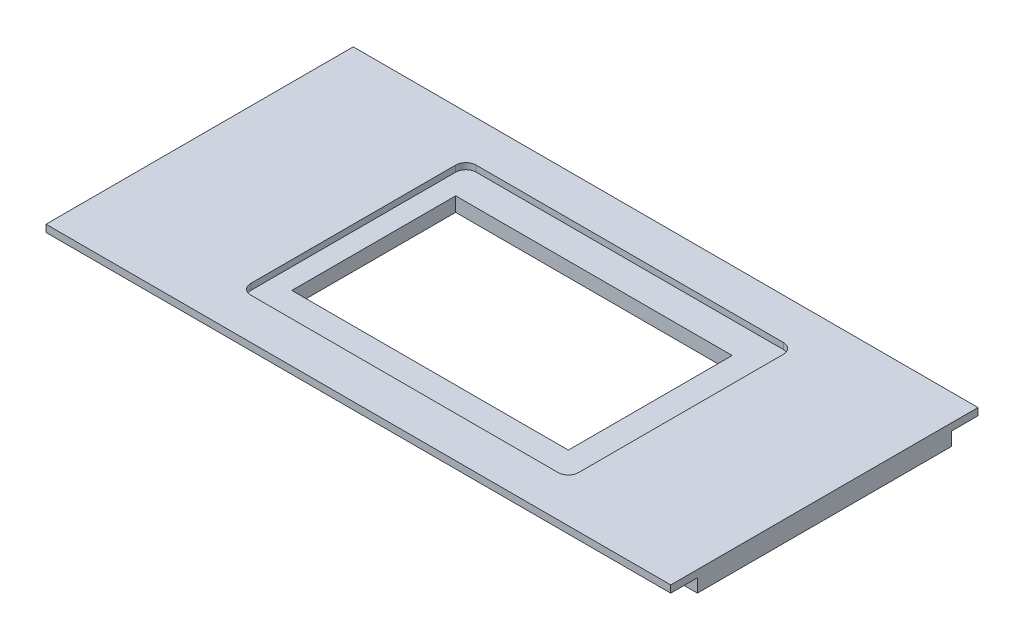
ISO-10303-21;
HEADER;
FILE_DESCRIPTION(('STEP AP214'),'2;1');
FILE_NAME('part.step','',(''),(''),'','','');
FILE_SCHEMA(('AUTOMOTIVE_DESIGN { 1 0 10303 214 1 1 1 1 }'));
ENDSEC;
DATA;
#1=APPLICATION_CONTEXT('core data for automotive mechanical design processes');
#2=APPLICATION_PROTOCOL_DEFINITION('international standard','automotive_design',2000,#1);
#3=PRODUCT_CONTEXT('',#1,'mechanical');
#4=PRODUCT('Part','Part','',(#3));
#5=PRODUCT_RELATED_PRODUCT_CATEGORY('part','',(#4));
#6=PRODUCT_DEFINITION_FORMATION('','',#4);
#7=PRODUCT_DEFINITION_CONTEXT('part definition',#1,'design');
#8=PRODUCT_DEFINITION('design','',#6,#7);
#9=PRODUCT_DEFINITION_SHAPE('','',#8);
#10=(LENGTH_UNIT() NAMED_UNIT(*) SI_UNIT(.MILLI.,.METRE.));
#11=(NAMED_UNIT(*) PLANE_ANGLE_UNIT() SI_UNIT($,.RADIAN.));
#12=(NAMED_UNIT(*) SI_UNIT($,.STERADIAN.) SOLID_ANGLE_UNIT());
#13=UNCERTAINTY_MEASURE_WITH_UNIT(LENGTH_MEASURE(1.E-05),#10,'distance_accuracy_value','');
#14=(GEOMETRIC_REPRESENTATION_CONTEXT(3) GLOBAL_UNCERTAINTY_ASSIGNED_CONTEXT((#13)) GLOBAL_UNIT_ASSIGNED_CONTEXT((#10,
#11,#12)) REPRESENTATION_CONTEXT('',''));
#15=CARTESIAN_POINT('',(0.,0.,0.));
#16=DIRECTION('',(0.,0.,1.));
#17=DIRECTION('',(1.,0.,0.));
#18=AXIS2_PLACEMENT_3D('',#15,#16,#17);
#19=CARTESIAN_POINT('',(0.,2.,0.));
#20=DIRECTION('',(0.,-1.,0.));
#21=DIRECTION('',(0.,0.,-1.));
#22=AXIS2_PLACEMENT_3D('',#19,#20,#21);
#23=PLANE('',#22);
#24=DIRECTION('',(0.,0.,1.));
#25=VECTOR('',#24,1.);
#26=CARTESIAN_POINT('',(-77.5,2.,55.));
#27=LINE('',#26,#25);
#28=CARTESIAN_POINT('',(-77.5,2.,-50.));
#29=VERTEX_POINT('',#28);
#30=CARTESIAN_POINT('',(-77.5,2.,50.));
#31=VERTEX_POINT('',#30);
#32=EDGE_CURVE('E212',#29,#31,#27,.T.);
#33=ORIENTED_EDGE('',*,*,#32,.T.);
#34=CARTESIAN_POINT('',(-72.5,2.,50.));
#35=DIRECTION('',(0.,-1.,0.));
#36=DIRECTION('',(0.,0.,-1.));
#37=AXIS2_PLACEMENT_3D('',#34,#35,#36);
#38=CIRCLE('',#37,5.);
#39=CARTESIAN_POINT('',(-72.5,2.,55.));
#40=VERTEX_POINT('',#39);
#41=EDGE_CURVE('E310',#31,#40,#38,.F.);
#42=ORIENTED_EDGE('',*,*,#41,.T.);
#43=DIRECTION('',(1.,0.,0.));
#44=VECTOR('',#43,1.);
#45=CARTESIAN_POINT('',(-77.5,2.,55.));
#46=LINE('',#45,#44);
#47=CARTESIAN_POINT('',(77.5,2.,55.));
#48=VERTEX_POINT('',#47);
#49=EDGE_CURVE('E215',#40,#48,#46,.T.);
#50=ORIENTED_EDGE('',*,*,#49,.T.);
#51=CARTESIAN_POINT('',(77.5,2.,50.));
#52=DIRECTION('',(0.,-1.,0.));
#53=DIRECTION('',(0.,0.,-1.));
#54=AXIS2_PLACEMENT_3D('',#51,#52,#53);
#55=CIRCLE('',#54,5.);
#56=CARTESIAN_POINT('',(82.5,2.,50.));
#57=VERTEX_POINT('',#56);
#58=EDGE_CURVE('E308',#48,#57,#55,.F.);
#59=ORIENTED_EDGE('',*,*,#58,.T.);
#60=DIRECTION('',(0.,0.,-1.));
#61=VECTOR('',#60,1.);
#62=CARTESIAN_POINT('',(82.5,2.,55.));
#63=LINE('',#62,#61);
#64=CARTESIAN_POINT('',(82.5,2.,-50.));
#65=VERTEX_POINT('',#64);
#66=EDGE_CURVE('E219',#57,#65,#63,.T.);
#67=ORIENTED_EDGE('',*,*,#66,.T.);
#68=CARTESIAN_POINT('',(77.5,2.,-50.));
#69=DIRECTION('',(0.,-1.,0.));
#70=DIRECTION('',(0.,0.,-1.));
#71=AXIS2_PLACEMENT_3D('',#68,#69,#70);
#72=CIRCLE('',#71,5.);
#73=CARTESIAN_POINT('',(77.5,2.,-55.));
#74=VERTEX_POINT('',#73);
#75=EDGE_CURVE('E306',#65,#74,#72,.F.);
#76=ORIENTED_EDGE('',*,*,#75,.T.);
#77=DIRECTION('',(-1.,0.,0.));
#78=VECTOR('',#77,1.);
#79=CARTESIAN_POINT('',(-77.5,2.,-55.));
#80=LINE('',#79,#78);
#81=CARTESIAN_POINT('',(-72.5,2.,-55.));
#82=VERTEX_POINT('',#81);
#83=EDGE_CURVE('E222',#74,#82,#80,.T.);
#84=ORIENTED_EDGE('',*,*,#83,.T.);
#85=CARTESIAN_POINT('',(-72.5,2.,-50.));
#86=DIRECTION('',(0.,-1.,0.));
#87=DIRECTION('',(0.,0.,-1.));
#88=AXIS2_PLACEMENT_3D('',#85,#86,#87);
#89=CIRCLE('',#88,5.);
#90=EDGE_CURVE('E304',#82,#29,#89,.F.);
#91=ORIENTED_EDGE('',*,*,#90,.T.);
#92=EDGE_LOOP('',(#33,#42,#50,#59,#67,#76,#84,#91));
#93=FACE_BOUND('',#92,.T.);
#94=DIRECTION('',(0.,0.,-1.));
#95=VECTOR('',#94,1.);
#96=CARTESIAN_POINT('',(67.5,2.,-40.));
#97=LINE('',#96,#95);
#98=CARTESIAN_POINT('',(67.5,2.,40.));
#99=VERTEX_POINT('',#98);
#100=CARTESIAN_POINT('',(67.5,2.,-40.));
#101=VERTEX_POINT('',#100);
#102=EDGE_CURVE('E180',#99,#101,#97,.T.);
#103=ORIENTED_EDGE('',*,*,#102,.F.);
#104=DIRECTION('',(1.,0.,0.));
#105=VECTOR('',#104,1.);
#106=CARTESIAN_POINT('',(-67.5,2.,40.));
#107=LINE('',#106,#105);
#108=CARTESIAN_POINT('',(-67.5,2.,40.));
#109=VERTEX_POINT('',#108);
#110=EDGE_CURVE('E195',#109,#99,#107,.T.);
#111=ORIENTED_EDGE('',*,*,#110,.F.);
#112=DIRECTION('',(0.,0.,1.));
#113=VECTOR('',#112,1.);
#114=CARTESIAN_POINT('',(-67.5,2.,-40.));
#115=LINE('',#114,#113);
#116=CARTESIAN_POINT('',(-67.5,2.,-40.));
#117=VERTEX_POINT('',#116);
#118=EDGE_CURVE('E53',#117,#109,#115,.T.);
#119=ORIENTED_EDGE('',*,*,#118,.F.);
#120=DIRECTION('',(-1.,0.,0.));
#121=VECTOR('',#120,1.);
#122=CARTESIAN_POINT('',(-67.5,2.,-40.));
#123=LINE('',#122,#121);
#124=EDGE_CURVE('E203',#101,#117,#123,.T.);
#125=ORIENTED_EDGE('',*,*,#124,.F.);
#126=EDGE_LOOP('',(#103,#111,#119,#125));
#127=FACE_BOUND('',#126,.T.);
#128=ADVANCED_FACE('F38',(#93,#127),#23,.F.);
#129=CARTESIAN_POINT('',(152.5,5.,-75.));
#130=DIRECTION('',(-1.,0.,0.));
#131=DIRECTION('',(0.,0.,1.));
#132=AXIS2_PLACEMENT_3D('',#129,#130,#131);
#133=PLANE('',#132);
#134=DIRECTION('',(0.,-1.,0.));
#135=VECTOR('',#134,1.);
#136=CARTESIAN_POINT('',(152.5,5.,75.));
#137=LINE('',#136,#135);
#138=CARTESIAN_POINT('',(152.5,5.,75.));
#139=VERTEX_POINT('',#138);
#140=CARTESIAN_POINT('',(152.5,1.5,75.));
#141=VERTEX_POINT('',#140);
#142=EDGE_CURVE('E278',#139,#141,#137,.T.);
#143=ORIENTED_EDGE('',*,*,#142,.T.);
#144=DIRECTION('',(0.,0.,1.));
#145=VECTOR('',#144,1.);
#146=CARTESIAN_POINT('',(152.5,1.5,75.));
#147=LINE('',#146,#145);
#148=CARTESIAN_POINT('',(152.5,1.5,62.));
#149=VERTEX_POINT('',#148);
#150=EDGE_CURVE('E245',#149,#141,#147,.T.);
#151=ORIENTED_EDGE('',*,*,#150,.F.);
#152=DIRECTION('',(0.,1.,0.));
#153=VECTOR('',#152,1.);
#154=CARTESIAN_POINT('',(152.5,-5.,62.));
#155=LINE('',#154,#153);
#156=CARTESIAN_POINT('',(152.5,-5.,62.));
#157=VERTEX_POINT('',#156);
#158=EDGE_CURVE('E242',#157,#149,#155,.T.);
#159=ORIENTED_EDGE('',*,*,#158,.F.);
#160=DIRECTION('',(0.,0.,-1.));
#161=VECTOR('',#160,1.);
#162=CARTESIAN_POINT('',(152.5,-5.,-75.));
#163=LINE('',#162,#161);
#164=CARTESIAN_POINT('',(152.5,-5.,-62.));
#165=VERTEX_POINT('',#164);
#166=EDGE_CURVE('E241',#157,#165,#163,.T.);
#167=ORIENTED_EDGE('',*,*,#166,.T.);
#168=DIRECTION('',(0.,-1.,0.));
#169=VECTOR('',#168,1.);
#170=CARTESIAN_POINT('',(152.5,-5.,-62.));
#171=LINE('',#170,#169);
#172=CARTESIAN_POINT('',(152.5,1.5,-62.));
#173=VERTEX_POINT('',#172);
#174=EDGE_CURVE('E258',#173,#165,#171,.T.);
#175=ORIENTED_EDGE('',*,*,#174,.F.);
#176=DIRECTION('',(0.,0.,1.));
#177=VECTOR('',#176,1.);
#178=CARTESIAN_POINT('',(152.5,1.5,-75.));
#179=LINE('',#178,#177);
#180=CARTESIAN_POINT('',(152.5,1.5,-75.));
#181=VERTEX_POINT('',#180);
#182=EDGE_CURVE('E246',#181,#173,#179,.T.);
#183=ORIENTED_EDGE('',*,*,#182,.F.);
#184=DIRECTION('',(0.,-1.,0.));
#185=VECTOR('',#184,1.);
#186=CARTESIAN_POINT('',(152.5,5.,-75.));
#187=LINE('',#186,#185);
#188=CARTESIAN_POINT('',(152.5,5.,-75.));
#189=VERTEX_POINT('',#188);
#190=EDGE_CURVE('E291',#189,#181,#187,.T.);
#191=ORIENTED_EDGE('',*,*,#190,.F.);
#192=DIRECTION('',(0.,0.,-1.));
#193=VECTOR('',#192,1.);
#194=CARTESIAN_POINT('',(152.5,5.,-75.));
#195=LINE('',#194,#193);
#196=EDGE_CURVE('E268',#139,#189,#195,.T.);
#197=ORIENTED_EDGE('',*,*,#196,.F.);
#198=EDGE_LOOP('',(#143,#151,#159,#167,#175,#183,#191,#197));
#199=FACE_BOUND('',#198,.T.);
#200=ADVANCED_FACE('F373',(#199),#133,.F.);
#201=CARTESIAN_POINT('',(-152.5,5.,-75.));
#202=DIRECTION('',(0.,0.,1.));
#203=DIRECTION('',(1.,0.,0.));
#204=AXIS2_PLACEMENT_3D('',#201,#202,#203);
#205=PLANE('',#204);
#206=ORIENTED_EDGE('',*,*,#190,.T.);
#207=DIRECTION('',(1.,0.,0.));
#208=VECTOR('',#207,1.);
#209=CARTESIAN_POINT('',(-167.034441853749,1.5,-74.9999999999999));
#210=LINE('',#209,#208);
#211=CARTESIAN_POINT('',(-152.5,1.5,-75.));
#212=VERTEX_POINT('',#211);
#213=EDGE_CURVE('E256',#212,#181,#210,.T.);
#214=ORIENTED_EDGE('',*,*,#213,.F.);
#215=DIRECTION('',(0.,-1.,0.));
#216=VECTOR('',#215,1.);
#217=CARTESIAN_POINT('',(-152.5,5.,-75.));
#218=LINE('',#217,#216);
#219=CARTESIAN_POINT('',(-152.5,5.,-75.));
#220=VERTEX_POINT('',#219);
#221=EDGE_CURVE('E288',#220,#212,#218,.T.);
#222=ORIENTED_EDGE('',*,*,#221,.F.);
#223=DIRECTION('',(-1.,0.,0.));
#224=VECTOR('',#223,1.);
#225=CARTESIAN_POINT('',(-152.5,5.,-75.));
#226=LINE('',#225,#224);
#227=EDGE_CURVE('E271',#189,#220,#226,.T.);
#228=ORIENTED_EDGE('',*,*,#227,.F.);
#229=EDGE_LOOP('',(#206,#214,#222,#228));
#230=FACE_BOUND('',#229,.T.);
#231=ADVANCED_FACE('F380',(#230),#205,.F.);
#232=CARTESIAN_POINT('',(-152.5,5.,-75.));
#233=DIRECTION('',(1.,0.,0.));
#234=DIRECTION('',(0.,0.,-1.));
#235=AXIS2_PLACEMENT_3D('',#232,#233,#234);
#236=PLANE('',#235);
#237=DIRECTION('',(0.,-1.,0.));
#238=VECTOR('',#237,1.);
#239=CARTESIAN_POINT('',(-152.5,-5.,62.));
#240=LINE('',#239,#238);
#241=CARTESIAN_POINT('',(-152.5,1.5,62.));
#242=VERTEX_POINT('',#241);
#243=CARTESIAN_POINT('',(-152.5,-5.,62.));
#244=VERTEX_POINT('',#243);
#245=EDGE_CURVE('E236',#242,#244,#240,.T.);
#246=ORIENTED_EDGE('',*,*,#245,.F.);
#247=DIRECTION('',(0.,0.,-1.));
#248=VECTOR('',#247,1.);
#249=CARTESIAN_POINT('',(-152.5,1.5,75.));
#250=LINE('',#249,#248);
#251=CARTESIAN_POINT('',(-152.5,1.5,75.));
#252=VERTEX_POINT('',#251);
#253=EDGE_CURVE('E238',#252,#242,#250,.T.);
#254=ORIENTED_EDGE('',*,*,#253,.F.);
#255=DIRECTION('',(0.,-1.,0.));
#256=VECTOR('',#255,1.);
#257=CARTESIAN_POINT('',(-152.5,5.,75.));
#258=LINE('',#257,#256);
#259=CARTESIAN_POINT('',(-152.5,5.,75.));
#260=VERTEX_POINT('',#259);
#261=EDGE_CURVE('E285',#260,#252,#258,.T.);
#262=ORIENTED_EDGE('',*,*,#261,.F.);
#263=DIRECTION('',(0.,0.,1.));
#264=VECTOR('',#263,1.);
#265=CARTESIAN_POINT('',(-152.5,5.,-75.));
#266=LINE('',#265,#264);
#267=EDGE_CURVE('E274',#220,#260,#266,.T.);
#268=ORIENTED_EDGE('',*,*,#267,.F.);
#269=ORIENTED_EDGE('',*,*,#221,.T.);
#270=DIRECTION('',(0.,0.,-1.));
#271=VECTOR('',#270,1.);
#272=CARTESIAN_POINT('',(-152.5,1.5,-74.9999999999999));
#273=LINE('',#272,#271);
#274=CARTESIAN_POINT('',(-152.5,1.5,-61.9999999999999));
#275=VERTEX_POINT('',#274);
#276=EDGE_CURVE('E225',#275,#212,#273,.T.);
#277=ORIENTED_EDGE('',*,*,#276,.F.);
#278=DIRECTION('',(0.,1.,0.));
#279=VECTOR('',#278,1.);
#280=CARTESIAN_POINT('',(-152.5,-5.,-61.9999999999999));
#281=LINE('',#280,#279);
#282=CARTESIAN_POINT('',(-152.5,-5.,-61.9999999999999));
#283=VERTEX_POINT('',#282);
#284=EDGE_CURVE('E255',#283,#275,#281,.T.);
#285=ORIENTED_EDGE('',*,*,#284,.F.);
#286=DIRECTION('',(0.,0.,1.));
#287=VECTOR('',#286,1.);
#288=CARTESIAN_POINT('',(-152.5,-5.,-75.));
#289=LINE('',#288,#287);
#290=EDGE_CURVE('E272',#283,#244,#289,.T.);
#291=ORIENTED_EDGE('',*,*,#290,.T.);
#292=EDGE_LOOP('',(#246,#254,#262,#268,#269,#277,#285,#291));
#293=FACE_BOUND('',#292,.T.);
#294=ADVANCED_FACE('F416',(#293),#236,.F.);
#295=CARTESIAN_POINT('',(-152.5,5.,75.));
#296=DIRECTION('',(0.,0.,-1.));
#297=DIRECTION('',(-1.,0.,0.));
#298=AXIS2_PLACEMENT_3D('',#295,#296,#297);
#299=PLANE('',#298);
#300=ORIENTED_EDGE('',*,*,#261,.T.);
#301=DIRECTION('',(1.,0.,0.));
#302=VECTOR('',#301,1.);
#303=CARTESIAN_POINT('',(-167.034441853749,1.5,75.));
#304=LINE('',#303,#302);
#305=EDGE_CURVE('E239',#252,#141,#304,.T.);
#306=ORIENTED_EDGE('',*,*,#305,.T.);
#307=ORIENTED_EDGE('',*,*,#142,.F.);
#308=DIRECTION('',(1.,0.,0.));
#309=VECTOR('',#308,1.);
#310=CARTESIAN_POINT('',(-152.5,5.,75.));
#311=LINE('',#310,#309);
#312=EDGE_CURVE('E276',#260,#139,#311,.T.);
#313=ORIENTED_EDGE('',*,*,#312,.F.);
#314=EDGE_LOOP('',(#300,#306,#307,#313));
#315=FACE_BOUND('',#314,.T.);
#316=ADVANCED_FACE('F412',(#315),#299,.F.);
#317=CARTESIAN_POINT('',(0.,5.,0.));
#318=DIRECTION('',(0.,1.,0.));
#319=DIRECTION('',(0.,0.,1.));
#320=AXIS2_PLACEMENT_3D('',#317,#318,#319);
#321=PLANE('',#320);
#322=DIRECTION('',(0.,0.,1.));
#323=VECTOR('',#322,1.);
#324=CARTESIAN_POINT('',(-77.5,5.,55.));
#325=LINE('',#324,#323);
#326=CARTESIAN_POINT('',(-77.5,5.,-50.));
#327=VERTEX_POINT('',#326);
#328=CARTESIAN_POINT('',(-77.5,5.,50.));
#329=VERTEX_POINT('',#328);
#330=EDGE_CURVE('E208',#327,#329,#325,.T.);
#331=ORIENTED_EDGE('',*,*,#330,.F.);
#332=CARTESIAN_POINT('',(-72.5,5.,-50.));
#333=DIRECTION('',(0.,1.,0.));
#334=DIRECTION('',(0.,0.,1.));
#335=AXIS2_PLACEMENT_3D('',#332,#333,#334);
#336=CIRCLE('',#335,5.);
#337=CARTESIAN_POINT('',(-72.5,5.,-55.));
#338=VERTEX_POINT('',#337);
#339=EDGE_CURVE('E11',#327,#338,#336,.F.);
#340=ORIENTED_EDGE('',*,*,#339,.T.);
#341=DIRECTION('',(-1.,0.,0.));
#342=VECTOR('',#341,1.);
#343=CARTESIAN_POINT('',(-77.5,5.,-55.));
#344=LINE('',#343,#342);
#345=CARTESIAN_POINT('',(77.5,5.,-55.));
#346=VERTEX_POINT('',#345);
#347=EDGE_CURVE('E216',#346,#338,#344,.T.);
#348=ORIENTED_EDGE('',*,*,#347,.F.);
#349=CARTESIAN_POINT('',(77.5,5.,-50.));
#350=DIRECTION('',(0.,1.,0.));
#351=DIRECTION('',(0.,0.,1.));
#352=AXIS2_PLACEMENT_3D('',#349,#350,#351);
#353=CIRCLE('',#352,5.);
#354=CARTESIAN_POINT('',(82.5,5.,-50.));
#355=VERTEX_POINT('',#354);
#356=EDGE_CURVE('E46',#346,#355,#353,.F.);
#357=ORIENTED_EDGE('',*,*,#356,.T.);
#358=DIRECTION('',(0.,0.,-1.));
#359=VECTOR('',#358,1.);
#360=CARTESIAN_POINT('',(82.5,5.,55.));
#361=LINE('',#360,#359);
#362=CARTESIAN_POINT('',(82.5,5.,50.));
#363=VERTEX_POINT('',#362);
#364=EDGE_CURVE('E231',#363,#355,#361,.T.);
#365=ORIENTED_EDGE('',*,*,#364,.F.);
#366=CARTESIAN_POINT('',(77.5,5.,50.));
#367=DIRECTION('',(0.,1.,0.));
#368=DIRECTION('',(0.,0.,1.));
#369=AXIS2_PLACEMENT_3D('',#366,#367,#368);
#370=CIRCLE('',#369,5.);
#371=CARTESIAN_POINT('',(77.5,5.,55.));
#372=VERTEX_POINT('',#371);
#373=EDGE_CURVE('E324',#363,#372,#370,.F.);
#374=ORIENTED_EDGE('',*,*,#373,.T.);
#375=DIRECTION('',(1.,0.,0.));
#376=VECTOR('',#375,1.);
#377=CARTESIAN_POINT('',(-77.5,5.,55.));
#378=LINE('',#377,#376);
#379=CARTESIAN_POINT('',(-72.5,5.,55.));
#380=VERTEX_POINT('',#379);
#381=EDGE_CURVE('E228',#380,#372,#378,.T.);
#382=ORIENTED_EDGE('',*,*,#381,.F.);
#383=CARTESIAN_POINT('',(-72.5,5.,50.));
#384=DIRECTION('',(0.,1.,0.));
#385=DIRECTION('',(0.,0.,1.));
#386=AXIS2_PLACEMENT_3D('',#383,#384,#385);
#387=CIRCLE('',#386,5.);
#388=EDGE_CURVE('E322',#380,#329,#387,.F.);
#389=ORIENTED_EDGE('',*,*,#388,.T.);
#390=EDGE_LOOP('',(#331,#340,#348,#357,#365,#374,#382,#389));
#391=FACE_BOUND('',#390,.T.);
#392=ORIENTED_EDGE('',*,*,#196,.T.);
#393=ORIENTED_EDGE('',*,*,#227,.T.);
#394=ORIENTED_EDGE('',*,*,#267,.T.);
#395=ORIENTED_EDGE('',*,*,#312,.T.);
#396=EDGE_LOOP('',(#392,#393,#394,#395));
#397=FACE_BOUND('',#396,.T.);
#398=ADVANCED_FACE('F329',(#391,#397),#321,.T.);
#399=CARTESIAN_POINT('',(0.,-5.,0.));
#400=DIRECTION('',(0.,1.,0.));
#401=DIRECTION('',(0.,0.,1.));
#402=AXIS2_PLACEMENT_3D('',#399,#400,#401);
#403=PLANE('',#402);
#404=DIRECTION('',(1.,0.,0.));
#405=VECTOR('',#404,1.);
#406=CARTESIAN_POINT('',(-67.5,-5.,40.));
#407=LINE('',#406,#405);
#408=CARTESIAN_POINT('',(-67.5,-5.,40.));
#409=VERTEX_POINT('',#408);
#410=CARTESIAN_POINT('',(67.5,-5.,40.));
#411=VERTEX_POINT('',#410);
#412=EDGE_CURVE('E185',#409,#411,#407,.T.);
#413=ORIENTED_EDGE('',*,*,#412,.T.);
#414=DIRECTION('',(0.,0.,-1.));
#415=VECTOR('',#414,1.);
#416=CARTESIAN_POINT('',(67.5,-5.,-40.));
#417=LINE('',#416,#415);
#418=CARTESIAN_POINT('',(67.5,-5.,-40.));
#419=VERTEX_POINT('',#418);
#420=EDGE_CURVE('E177',#411,#419,#417,.T.);
#421=ORIENTED_EDGE('',*,*,#420,.T.);
#422=DIRECTION('',(-1.,0.,0.));
#423=VECTOR('',#422,1.);
#424=CARTESIAN_POINT('',(-67.5,-5.,-40.));
#425=LINE('',#424,#423);
#426=CARTESIAN_POINT('',(-67.5,-5.,-40.));
#427=VERTEX_POINT('',#426);
#428=EDGE_CURVE('E188',#419,#427,#425,.T.);
#429=ORIENTED_EDGE('',*,*,#428,.T.);
#430=DIRECTION('',(0.,0.,1.));
#431=VECTOR('',#430,1.);
#432=CARTESIAN_POINT('',(-67.5,-5.,-40.));
#433=LINE('',#432,#431);
#434=EDGE_CURVE('E58',#427,#409,#433,.T.);
#435=ORIENTED_EDGE('',*,*,#434,.T.);
#436=EDGE_LOOP('',(#413,#421,#429,#435));
#437=FACE_BOUND('',#436,.T.);
#438=ORIENTED_EDGE('',*,*,#166,.F.);
#439=DIRECTION('',(1.,0.,0.));
#440=VECTOR('',#439,1.);
#441=CARTESIAN_POINT('',(-167.034441853749,-5.,62.));
#442=LINE('',#441,#440);
#443=EDGE_CURVE('E248',#244,#157,#442,.T.);
#444=ORIENTED_EDGE('',*,*,#443,.F.);
#445=ORIENTED_EDGE('',*,*,#290,.F.);
#446=DIRECTION('',(1.,0.,0.));
#447=VECTOR('',#446,1.);
#448=CARTESIAN_POINT('',(-167.034441853749,-5.,-61.9999999999999));
#449=LINE('',#448,#447);
#450=EDGE_CURVE('E261',#283,#165,#449,.T.);
#451=ORIENTED_EDGE('',*,*,#450,.T.);
#452=EDGE_LOOP('',(#438,#444,#445,#451));
#453=FACE_BOUND('',#452,.T.);
#454=ADVANCED_FACE('F192',(#437,#453),#403,.F.);
#455=CARTESIAN_POINT('',(-167.034441853749,-5.,-61.9999999999999));
#456=DIRECTION('',(0.,0.,1.));
#457=DIRECTION('',(1.,0.,0.));
#458=AXIS2_PLACEMENT_3D('',#455,#456,#457);
#459=PLANE('',#458);
#460=ORIENTED_EDGE('',*,*,#284,.T.);
#461=DIRECTION('',(1.,0.,0.));
#462=VECTOR('',#461,1.);
#463=CARTESIAN_POINT('',(-167.034441853749,1.5,-61.9999999999999));
#464=LINE('',#463,#462);
#465=EDGE_CURVE('E259',#275,#173,#464,.T.);
#466=ORIENTED_EDGE('',*,*,#465,.T.);
#467=ORIENTED_EDGE('',*,*,#174,.T.);
#468=ORIENTED_EDGE('',*,*,#450,.F.);
#469=EDGE_LOOP('',(#460,#466,#467,#468));
#470=FACE_BOUND('',#469,.T.);
#471=ADVANCED_FACE('F405',(#470),#459,.F.);
#472=CARTESIAN_POINT('',(-167.034441853749,1.5,-74.9999999999999));
#473=DIRECTION('',(0.,1.,0.));
#474=DIRECTION('',(0.,0.,1.));
#475=AXIS2_PLACEMENT_3D('',#472,#473,#474);
#476=PLANE('',#475);
#477=ORIENTED_EDGE('',*,*,#276,.T.);
#478=ORIENTED_EDGE('',*,*,#213,.T.);
#479=ORIENTED_EDGE('',*,*,#182,.T.);
#480=ORIENTED_EDGE('',*,*,#465,.F.);
#481=EDGE_LOOP('',(#477,#478,#479,#480));
#482=FACE_BOUND('',#481,.T.);
#483=ADVANCED_FACE('F398',(#482),#476,.F.);
#484=CARTESIAN_POINT('',(-167.034441853749,1.5,75.));
#485=DIRECTION('',(0.,1.,0.));
#486=DIRECTION('',(0.,0.,1.));
#487=AXIS2_PLACEMENT_3D('',#484,#485,#486);
#488=PLANE('',#487);
#489=ORIENTED_EDGE('',*,*,#253,.T.);
#490=DIRECTION('',(1.,0.,0.));
#491=VECTOR('',#490,1.);
#492=CARTESIAN_POINT('',(-167.034441853749,1.5,62.));
#493=LINE('',#492,#491);
#494=EDGE_CURVE('E251',#242,#149,#493,.T.);
#495=ORIENTED_EDGE('',*,*,#494,.T.);
#496=ORIENTED_EDGE('',*,*,#150,.T.);
#497=ORIENTED_EDGE('',*,*,#305,.F.);
#498=EDGE_LOOP('',(#489,#495,#496,#497));
#499=FACE_BOUND('',#498,.T.);
#500=ADVANCED_FACE('F395',(#499),#488,.F.);
#501=CARTESIAN_POINT('',(-167.034441853749,-5.,62.));
#502=DIRECTION('',(0.,0.,-1.));
#503=DIRECTION('',(-1.,0.,0.));
#504=AXIS2_PLACEMENT_3D('',#501,#502,#503);
#505=PLANE('',#504);
#506=ORIENTED_EDGE('',*,*,#245,.T.);
#507=ORIENTED_EDGE('',*,*,#443,.T.);
#508=ORIENTED_EDGE('',*,*,#158,.T.);
#509=ORIENTED_EDGE('',*,*,#494,.F.);
#510=EDGE_LOOP('',(#506,#507,#508,#509));
#511=FACE_BOUND('',#510,.T.);
#512=ADVANCED_FACE('F394',(#511),#505,.F.);
#513=CARTESIAN_POINT('',(-77.5,2.,55.));
#514=DIRECTION('',(-1.,0.,0.));
#515=DIRECTION('',(0.,0.,1.));
#516=AXIS2_PLACEMENT_3D('',#513,#514,#515);
#517=PLANE('',#516);
#518=ORIENTED_EDGE('',*,*,#330,.T.);
#519=DIRECTION('',(0.,1.,0.));
#520=VECTOR('',#519,1.);
#521=CARTESIAN_POINT('',(-77.5,2.,50.));
#522=LINE('',#521,#520);
#523=EDGE_CURVE('E302',#329,#31,#522,.F.);
#524=ORIENTED_EDGE('',*,*,#523,.T.);
#525=ORIENTED_EDGE('',*,*,#32,.F.);
#526=DIRECTION('',(0.,1.,0.));
#527=VECTOR('',#526,1.);
#528=CARTESIAN_POINT('',(-77.5,5.,-50.));
#529=LINE('',#528,#527);
#530=EDGE_CURVE('E299',#29,#327,#529,.T.);
#531=ORIENTED_EDGE('',*,*,#530,.T.);
#532=EDGE_LOOP('',(#518,#524,#525,#531));
#533=FACE_BOUND('',#532,.T.);
#534=ADVANCED_FACE('F352',(#533),#517,.F.);
#535=CARTESIAN_POINT('',(-77.5,2.,-55.));
#536=DIRECTION('',(0.,0.,-1.));
#537=DIRECTION('',(-1.,0.,0.));
#538=AXIS2_PLACEMENT_3D('',#535,#536,#537);
#539=PLANE('',#538);
#540=ORIENTED_EDGE('',*,*,#83,.F.);
#541=DIRECTION('',(0.,1.,0.));
#542=VECTOR('',#541,1.);
#543=CARTESIAN_POINT('',(77.5,5.,-55.));
#544=LINE('',#543,#542);
#545=EDGE_CURVE('E319',#74,#346,#544,.T.);
#546=ORIENTED_EDGE('',*,*,#545,.T.);
#547=ORIENTED_EDGE('',*,*,#347,.T.);
#548=DIRECTION('',(0.,1.,0.));
#549=VECTOR('',#548,1.);
#550=CARTESIAN_POINT('',(-72.5,2.,-55.));
#551=LINE('',#550,#549);
#552=EDGE_CURVE('E317',#338,#82,#551,.F.);
#553=ORIENTED_EDGE('',*,*,#552,.T.);
#554=EDGE_LOOP('',(#540,#546,#547,#553));
#555=FACE_BOUND('',#554,.T.);
#556=ADVANCED_FACE('F345',(#555),#539,.F.);
#557=CARTESIAN_POINT('',(82.5,2.,55.));
#558=DIRECTION('',(1.,0.,0.));
#559=DIRECTION('',(0.,0.,-1.));
#560=AXIS2_PLACEMENT_3D('',#557,#558,#559);
#561=PLANE('',#560);
#562=ORIENTED_EDGE('',*,*,#66,.F.);
#563=DIRECTION('',(0.,1.,0.));
#564=VECTOR('',#563,1.);
#565=CARTESIAN_POINT('',(82.5,5.,50.));
#566=LINE('',#565,#564);
#567=EDGE_CURVE('E314',#57,#363,#566,.T.);
#568=ORIENTED_EDGE('',*,*,#567,.T.);
#569=ORIENTED_EDGE('',*,*,#364,.T.);
#570=DIRECTION('',(0.,1.,0.));
#571=VECTOR('',#570,1.);
#572=CARTESIAN_POINT('',(82.5,2.,-50.));
#573=LINE('',#572,#571);
#574=EDGE_CURVE('E312',#355,#65,#573,.F.);
#575=ORIENTED_EDGE('',*,*,#574,.T.);
#576=EDGE_LOOP('',(#562,#568,#569,#575));
#577=FACE_BOUND('',#576,.T.);
#578=ADVANCED_FACE('F336',(#577),#561,.F.);
#579=CARTESIAN_POINT('',(-77.5,2.,55.));
#580=DIRECTION('',(0.,0.,1.));
#581=DIRECTION('',(1.,0.,0.));
#582=AXIS2_PLACEMENT_3D('',#579,#580,#581);
#583=PLANE('',#582);
#584=ORIENTED_EDGE('',*,*,#49,.F.);
#585=DIRECTION('',(0.,1.,0.));
#586=VECTOR('',#585,1.);
#587=CARTESIAN_POINT('',(-72.5,5.,55.));
#588=LINE('',#587,#586);
#589=EDGE_CURVE('E296',#40,#380,#588,.T.);
#590=ORIENTED_EDGE('',*,*,#589,.T.);
#591=ORIENTED_EDGE('',*,*,#381,.T.);
#592=DIRECTION('',(0.,1.,0.));
#593=VECTOR('',#592,1.);
#594=CARTESIAN_POINT('',(77.5,2.,55.));
#595=LINE('',#594,#593);
#596=EDGE_CURVE('E294',#372,#48,#595,.F.);
#597=ORIENTED_EDGE('',*,*,#596,.T.);
#598=EDGE_LOOP('',(#584,#590,#591,#597));
#599=FACE_BOUND('',#598,.T.);
#600=ADVANCED_FACE('F360',(#599),#583,.F.);
#601=CARTESIAN_POINT('',(-72.5,2.,50.));
#602=DIRECTION('',(0.,-1.,0.));
#603=DIRECTION('',(0.,0.,-1.));
#604=AXIS2_PLACEMENT_3D('',#601,#602,#603);
#605=CYLINDRICAL_SURFACE('',#604,5.);
#606=ORIENTED_EDGE('',*,*,#41,.F.);
#607=ORIENTED_EDGE('',*,*,#523,.F.);
#608=ORIENTED_EDGE('',*,*,#388,.F.);
#609=ORIENTED_EDGE('',*,*,#589,.F.);
#610=EDGE_LOOP('',(#606,#607,#608,#609));
#611=FACE_BOUND('',#610,.T.);
#612=ADVANCED_FACE('F355',(#611),#605,.F.);
#613=CARTESIAN_POINT('',(77.5,2.,50.));
#614=DIRECTION('',(0.,-1.,0.));
#615=DIRECTION('',(0.,0.,-1.));
#616=AXIS2_PLACEMENT_3D('',#613,#614,#615);
#617=CYLINDRICAL_SURFACE('',#616,5.);
#618=ORIENTED_EDGE('',*,*,#58,.F.);
#619=ORIENTED_EDGE('',*,*,#596,.F.);
#620=ORIENTED_EDGE('',*,*,#373,.F.);
#621=ORIENTED_EDGE('',*,*,#567,.F.);
#622=EDGE_LOOP('',(#618,#619,#620,#621));
#623=FACE_BOUND('',#622,.T.);
#624=ADVANCED_FACE('F364',(#623),#617,.F.);
#625=CARTESIAN_POINT('',(77.5,2.,-50.));
#626=DIRECTION('',(0.,-1.,0.));
#627=DIRECTION('',(0.,0.,-1.));
#628=AXIS2_PLACEMENT_3D('',#625,#626,#627);
#629=CYLINDRICAL_SURFACE('',#628,5.);
#630=ORIENTED_EDGE('',*,*,#75,.F.);
#631=ORIENTED_EDGE('',*,*,#574,.F.);
#632=ORIENTED_EDGE('',*,*,#356,.F.);
#633=ORIENTED_EDGE('',*,*,#545,.F.);
#634=EDGE_LOOP('',(#630,#631,#632,#633));
#635=FACE_BOUND('',#634,.T.);
#636=ADVANCED_FACE('F339',(#635),#629,.F.);
#637=CARTESIAN_POINT('',(-72.5,2.,-50.));
#638=DIRECTION('',(0.,-1.,0.));
#639=DIRECTION('',(0.,0.,-1.));
#640=AXIS2_PLACEMENT_3D('',#637,#638,#639);
#641=CYLINDRICAL_SURFACE('',#640,5.);
#642=ORIENTED_EDGE('',*,*,#90,.F.);
#643=ORIENTED_EDGE('',*,*,#552,.F.);
#644=ORIENTED_EDGE('',*,*,#339,.F.);
#645=ORIENTED_EDGE('',*,*,#530,.F.);
#646=EDGE_LOOP('',(#642,#643,#644,#645));
#647=FACE_BOUND('',#646,.T.);
#648=ADVANCED_FACE('F40',(#647),#641,.F.);
#649=CARTESIAN_POINT('',(67.5,-5.,-40.));
#650=DIRECTION('',(1.,0.,0.));
#651=DIRECTION('',(0.,0.,-1.));
#652=AXIS2_PLACEMENT_3D('',#649,#650,#651);
#653=PLANE('',#652);
#654=ORIENTED_EDGE('',*,*,#102,.T.);
#655=DIRECTION('',(0.,1.,0.));
#656=VECTOR('',#655,1.);
#657=CARTESIAN_POINT('',(67.5,-5.,-40.));
#658=LINE('',#657,#656);
#659=EDGE_CURVE('E173',#419,#101,#658,.T.);
#660=ORIENTED_EDGE('',*,*,#659,.F.);
#661=ORIENTED_EDGE('',*,*,#420,.F.);
#662=DIRECTION('',(0.,1.,0.));
#663=VECTOR('',#662,1.);
#664=CARTESIAN_POINT('',(67.5,-5.,40.));
#665=LINE('',#664,#663);
#666=EDGE_CURVE('E206',#411,#99,#665,.T.);
#667=ORIENTED_EDGE('',*,*,#666,.T.);
#668=EDGE_LOOP('',(#654,#660,#661,#667));
#669=FACE_BOUND('',#668,.T.);
#670=ADVANCED_FACE('F175',(#669),#653,.F.);
#671=CARTESIAN_POINT('',(-67.5,-5.,40.));
#672=DIRECTION('',(0.,0.,1.));
#673=DIRECTION('',(1.,0.,0.));
#674=AXIS2_PLACEMENT_3D('',#671,#672,#673);
#675=PLANE('',#674);
#676=ORIENTED_EDGE('',*,*,#110,.T.);
#677=ORIENTED_EDGE('',*,*,#666,.F.);
#678=ORIENTED_EDGE('',*,*,#412,.F.);
#679=DIRECTION('',(0.,1.,0.));
#680=VECTOR('',#679,1.);
#681=CARTESIAN_POINT('',(-67.5,-5.,40.));
#682=LINE('',#681,#680);
#683=EDGE_CURVE('E209',#409,#109,#682,.T.);
#684=ORIENTED_EDGE('',*,*,#683,.T.);
#685=EDGE_LOOP('',(#676,#677,#678,#684));
#686=FACE_BOUND('',#685,.T.);
#687=ADVANCED_FACE('F539',(#686),#675,.F.);
#688=CARTESIAN_POINT('',(-67.5,-5.,-40.));
#689=DIRECTION('',(-1.,0.,0.));
#690=DIRECTION('',(0.,0.,1.));
#691=AXIS2_PLACEMENT_3D('',#688,#689,#690);
#692=PLANE('',#691);
#693=ORIENTED_EDGE('',*,*,#118,.T.);
#694=ORIENTED_EDGE('',*,*,#683,.F.);
#695=ORIENTED_EDGE('',*,*,#434,.F.);
#696=DIRECTION('',(0.,1.,0.));
#697=VECTOR('',#696,1.);
#698=CARTESIAN_POINT('',(-67.5,-5.,-40.));
#699=LINE('',#698,#697);
#700=EDGE_CURVE('E184',#427,#117,#699,.T.);
#701=ORIENTED_EDGE('',*,*,#700,.T.);
#702=EDGE_LOOP('',(#693,#694,#695,#701));
#703=FACE_BOUND('',#702,.T.);
#704=ADVANCED_FACE('F547',(#703),#692,.F.);
#705=CARTESIAN_POINT('',(-67.5,-5.,-40.));
#706=DIRECTION('',(0.,0.,-1.));
#707=DIRECTION('',(-1.,0.,0.));
#708=AXIS2_PLACEMENT_3D('',#705,#706,#707);
#709=PLANE('',#708);
#710=ORIENTED_EDGE('',*,*,#124,.T.);
#711=ORIENTED_EDGE('',*,*,#700,.F.);
#712=ORIENTED_EDGE('',*,*,#428,.F.);
#713=ORIENTED_EDGE('',*,*,#659,.T.);
#714=EDGE_LOOP('',(#710,#711,#712,#713));
#715=FACE_BOUND('',#714,.T.);
#716=ADVANCED_FACE('F189',(#715),#709,.F.);
#717=CLOSED_SHELL('',(#128,#200,#231,#294,#316,#398,#454,#471,#483,#500,#512,#534,#556,#578,
#600,#612,#624,#636,#648,#670,#687,#704,#716));
#718=MANIFOLD_SOLID_BREP('B2',#717);
#719=ADVANCED_BREP_SHAPE_REPRESENTATION('',(#18,#718),#14);
#720=SHAPE_DEFINITION_REPRESENTATION(#9,#719);
ENDSEC;
END-ISO-10303-21;
